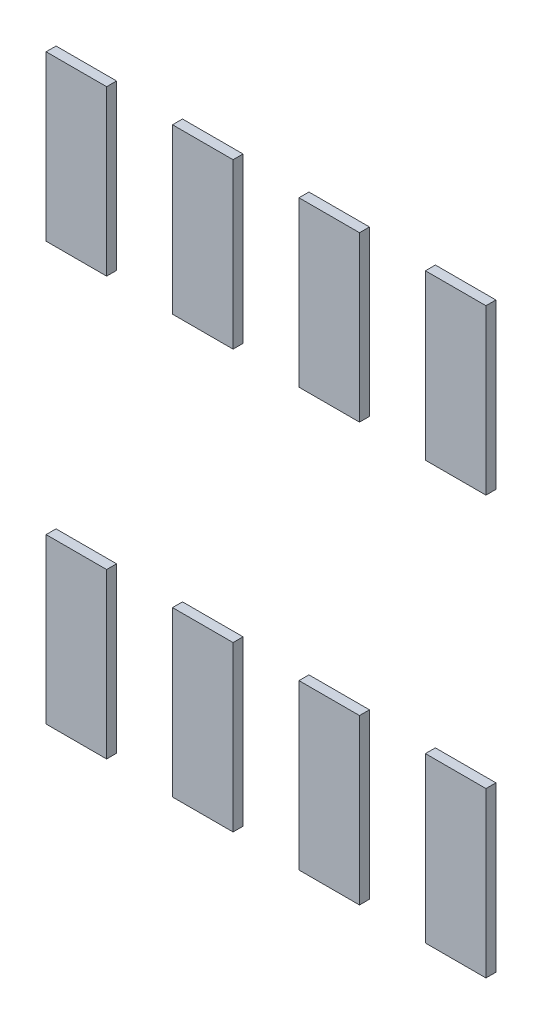
ISO-10303-21;
HEADER;
FILE_DESCRIPTION(('STEP AP214'),'2;1');
FILE_NAME('part.step','',(''),(''),'','','');
FILE_SCHEMA(('AUTOMOTIVE_DESIGN { 1 0 10303 214 1 1 1 1 }'));
ENDSEC;
DATA;
#1=APPLICATION_CONTEXT('core data for automotive mechanical design processes');
#2=APPLICATION_PROTOCOL_DEFINITION('international standard','automotive_design',2000,#1);
#3=PRODUCT_CONTEXT('',#1,'mechanical');
#4=PRODUCT('Part','Part','',(#3));
#5=PRODUCT_RELATED_PRODUCT_CATEGORY('part','',(#4));
#6=PRODUCT_DEFINITION_FORMATION('','',#4);
#7=PRODUCT_DEFINITION_CONTEXT('part definition',#1,'design');
#8=PRODUCT_DEFINITION('design','',#6,#7);
#9=PRODUCT_DEFINITION_SHAPE('','',#8);
#10=(LENGTH_UNIT() NAMED_UNIT(*) SI_UNIT(.MILLI.,.METRE.));
#11=(NAMED_UNIT(*) PLANE_ANGLE_UNIT() SI_UNIT($,.RADIAN.));
#12=(NAMED_UNIT(*) SI_UNIT($,.STERADIAN.) SOLID_ANGLE_UNIT());
#13=UNCERTAINTY_MEASURE_WITH_UNIT(LENGTH_MEASURE(1.E-05),#10,'distance_accuracy_value','');
#14=(GEOMETRIC_REPRESENTATION_CONTEXT(3) GLOBAL_UNCERTAINTY_ASSIGNED_CONTEXT((#13)) GLOBAL_UNIT_ASSIGNED_CONTEXT((#10,
#11,#12)) REPRESENTATION_CONTEXT('',''));
#15=CARTESIAN_POINT('',(0.,0.,0.));
#16=DIRECTION('',(0.,0.,1.));
#17=DIRECTION('',(1.,0.,0.));
#18=AXIS2_PLACEMENT_3D('',#15,#16,#17);
#19=CARTESIAN_POINT('',(-2.209,1.276,0.1));
#20=DIRECTION('',(0.,0.,1.));
#21=DIRECTION('',(1.,0.,0.));
#22=AXIS2_PLACEMENT_3D('',#19,#20,#21);
#23=PLANE('',#22);
#24=DIRECTION('',(0.,1.,0.));
#25=VECTOR('',#24,1.);
#26=CARTESIAN_POINT('',(-2.209,1.276,0.1));
#27=LINE('',#26,#25);
#28=CARTESIAN_POINT('',(-2.209,1.276,0.1));
#29=VERTEX_POINT('',#28);
#30=CARTESIAN_POINT('',(-2.209,2.924,0.1));
#31=VERTEX_POINT('',#30);
#32=EDGE_CURVE('P0_E65',#29,#31,#27,.T.);
#33=ORIENTED_EDGE('',*,*,#32,.F.);
#34=DIRECTION('',(1.,0.,0.));
#35=VECTOR('',#34,1.);
#36=CARTESIAN_POINT('',(-2.209,1.276,0.1));
#37=LINE('',#36,#35);
#38=CARTESIAN_POINT('',(-1.601,1.276,0.1));
#39=VERTEX_POINT('',#38);
#40=EDGE_CURVE('P0_E59',#29,#39,#37,.T.);
#41=ORIENTED_EDGE('',*,*,#40,.T.);
#42=DIRECTION('',(0.,1.,0.));
#43=VECTOR('',#42,1.);
#44=CARTESIAN_POINT('',(-1.601,1.276,0.1));
#45=LINE('',#44,#43);
#46=CARTESIAN_POINT('',(-1.601,2.924,0.1));
#47=VERTEX_POINT('',#46);
#48=EDGE_CURVE('P0_E61',#39,#47,#45,.T.);
#49=ORIENTED_EDGE('',*,*,#48,.T.);
#50=DIRECTION('',(1.,0.,0.));
#51=VECTOR('',#50,1.);
#52=CARTESIAN_POINT('',(-2.209,2.924,0.1));
#53=LINE('',#52,#51);
#54=EDGE_CURVE('P0_E11',#31,#47,#53,.T.);
#55=ORIENTED_EDGE('',*,*,#54,.F.);
#56=EDGE_LOOP('',(#33,#41,#49,#55));
#57=FACE_BOUND('',#56,.T.);
#58=ADVANCED_FACE('P0_F17',(#57),#23,.T.);
#59=CARTESIAN_POINT('',(-2.209,1.276,0.));
#60=DIRECTION('',(0.,0.,1.));
#61=DIRECTION('',(1.,0.,0.));
#62=AXIS2_PLACEMENT_3D('',#59,#60,#61);
#63=PLANE('',#62);
#64=DIRECTION('',(1.,0.,0.));
#65=VECTOR('',#64,1.);
#66=CARTESIAN_POINT('',(-2.209,2.924,0.));
#67=LINE('',#66,#65);
#68=CARTESIAN_POINT('',(-2.209,2.924,0.));
#69=VERTEX_POINT('',#68);
#70=CARTESIAN_POINT('',(-1.601,2.924,0.));
#71=VERTEX_POINT('',#70);
#72=EDGE_CURVE('P0_E21',#69,#71,#67,.T.);
#73=ORIENTED_EDGE('',*,*,#72,.T.);
#74=DIRECTION('',(0.,1.,0.));
#75=VECTOR('',#74,1.);
#76=CARTESIAN_POINT('',(-1.601,1.276,0.));
#77=LINE('',#76,#75);
#78=CARTESIAN_POINT('',(-1.601,1.276,0.));
#79=VERTEX_POINT('',#78);
#80=EDGE_CURVE('P0_E83',#79,#71,#77,.T.);
#81=ORIENTED_EDGE('',*,*,#80,.F.);
#82=DIRECTION('',(1.,0.,0.));
#83=VECTOR('',#82,1.);
#84=CARTESIAN_POINT('',(-2.209,1.276,0.));
#85=LINE('',#84,#83);
#86=CARTESIAN_POINT('',(-2.209,1.276,0.));
#87=VERTEX_POINT('',#86);
#88=EDGE_CURVE('P0_E71',#87,#79,#85,.T.);
#89=ORIENTED_EDGE('',*,*,#88,.F.);
#90=DIRECTION('',(0.,1.,0.));
#91=VECTOR('',#90,1.);
#92=CARTESIAN_POINT('',(-2.209,1.276,0.));
#93=LINE('',#92,#91);
#94=EDGE_CURVE('P0_E92',#87,#69,#93,.T.);
#95=ORIENTED_EDGE('',*,*,#94,.T.);
#96=EDGE_LOOP('',(#73,#81,#89,#95));
#97=FACE_BOUND('',#96,.T.);
#98=ADVANCED_FACE('P0_F19',(#97),#63,.F.);
#99=CARTESIAN_POINT('',(-2.209,2.924,0.));
#100=DIRECTION('',(0.,1.,0.));
#101=DIRECTION('',(1.,0.,0.));
#102=AXIS2_PLACEMENT_3D('',#99,#100,#101);
#103=PLANE('',#102);
#104=ORIENTED_EDGE('',*,*,#72,.F.);
#105=DIRECTION('',(0.,0.,1.));
#106=VECTOR('',#105,1.);
#107=CARTESIAN_POINT('',(-2.209,2.924,0.));
#108=LINE('',#107,#106);
#109=EDGE_CURVE('P0_E117',#69,#31,#108,.T.);
#110=ORIENTED_EDGE('',*,*,#109,.T.);
#111=ORIENTED_EDGE('',*,*,#54,.T.);
#112=DIRECTION('',(0.,0.,1.));
#113=VECTOR('',#112,1.);
#114=CARTESIAN_POINT('',(-1.601,2.924,0.));
#115=LINE('',#114,#113);
#116=EDGE_CURVE('P0_E77',#71,#47,#115,.T.);
#117=ORIENTED_EDGE('',*,*,#116,.F.);
#118=EDGE_LOOP('',(#104,#110,#111,#117));
#119=FACE_BOUND('',#118,.T.);
#120=ADVANCED_FACE('P0_F154',(#119),#103,.T.);
#121=CARTESIAN_POINT('',(-2.209,1.276,0.));
#122=DIRECTION('',(0.,1.,0.));
#123=DIRECTION('',(1.,0.,0.));
#124=AXIS2_PLACEMENT_3D('',#121,#122,#123);
#125=PLANE('',#124);
#126=DIRECTION('',(0.,0.,1.));
#127=VECTOR('',#126,1.);
#128=CARTESIAN_POINT('',(-1.601,1.276,0.));
#129=LINE('',#128,#127);
#130=EDGE_CURVE('P0_E76',#79,#39,#129,.T.);
#131=ORIENTED_EDGE('',*,*,#130,.T.);
#132=ORIENTED_EDGE('',*,*,#40,.F.);
#133=DIRECTION('',(0.,0.,1.));
#134=VECTOR('',#133,1.);
#135=CARTESIAN_POINT('',(-2.209,1.276,0.));
#136=LINE('',#135,#134);
#137=EDGE_CURVE('P0_E84',#87,#29,#136,.T.);
#138=ORIENTED_EDGE('',*,*,#137,.F.);
#139=ORIENTED_EDGE('',*,*,#88,.T.);
#140=EDGE_LOOP('',(#131,#132,#138,#139));
#141=FACE_BOUND('',#140,.T.);
#142=ADVANCED_FACE('P0_F80',(#141),#125,.F.);
#143=CARTESIAN_POINT('',(-1.601,1.276,0.));
#144=DIRECTION('',(1.,0.,0.));
#145=DIRECTION('',(0.,1.,0.));
#146=AXIS2_PLACEMENT_3D('',#143,#144,#145);
#147=PLANE('',#146);
#148=ORIENTED_EDGE('',*,*,#130,.F.);
#149=ORIENTED_EDGE('',*,*,#80,.T.);
#150=ORIENTED_EDGE('',*,*,#116,.T.);
#151=ORIENTED_EDGE('',*,*,#48,.F.);
#152=EDGE_LOOP('',(#148,#149,#150,#151));
#153=FACE_BOUND('',#152,.T.);
#154=ADVANCED_FACE('P0_F74',(#153),#147,.T.);
#155=CARTESIAN_POINT('',(-2.209,1.276,0.));
#156=DIRECTION('',(1.,0.,0.));
#157=DIRECTION('',(0.,1.,0.));
#158=AXIS2_PLACEMENT_3D('',#155,#156,#157);
#159=PLANE('',#158);
#160=ORIENTED_EDGE('',*,*,#32,.T.);
#161=ORIENTED_EDGE('',*,*,#109,.F.);
#162=ORIENTED_EDGE('',*,*,#94,.F.);
#163=ORIENTED_EDGE('',*,*,#137,.T.);
#164=EDGE_LOOP('',(#160,#161,#162,#163));
#165=FACE_BOUND('',#164,.T.);
#166=ADVANCED_FACE('P0_F141',(#165),#159,.F.);
#167=CLOSED_SHELL('',(#58,#98,#120,#142,#154,#166));
#168=MANIFOLD_SOLID_BREP('P0_B1',#167);
#169=CARTESIAN_POINT('',(-2.209,-2.924,0.1));
#170=DIRECTION('',(0.,0.,1.));
#171=DIRECTION('',(1.,0.,0.));
#172=AXIS2_PLACEMENT_3D('',#169,#170,#171);
#173=PLANE('',#172);
#174=DIRECTION('',(0.,1.,0.));
#175=VECTOR('',#174,1.);
#176=CARTESIAN_POINT('',(-2.209,-2.924,0.1));
#177=LINE('',#176,#175);
#178=CARTESIAN_POINT('',(-2.209,-2.924,0.1));
#179=VERTEX_POINT('',#178);
#180=CARTESIAN_POINT('',(-2.209,-1.276,0.1));
#181=VERTEX_POINT('',#180);
#182=EDGE_CURVE('P1_E108',#179,#181,#177,.T.);
#183=ORIENTED_EDGE('',*,*,#182,.F.);
#184=DIRECTION('',(1.,0.,0.));
#185=VECTOR('',#184,1.);
#186=CARTESIAN_POINT('',(-2.209,-2.924,0.1));
#187=LINE('',#186,#185);
#188=CARTESIAN_POINT('',(-1.601,-2.924,0.1));
#189=VERTEX_POINT('',#188);
#190=EDGE_CURVE('P1_E78',#179,#189,#187,.T.);
#191=ORIENTED_EDGE('',*,*,#190,.T.);
#192=DIRECTION('',(0.,1.,0.));
#193=VECTOR('',#192,1.);
#194=CARTESIAN_POINT('',(-1.601,-2.924,0.1));
#195=LINE('',#194,#193);
#196=CARTESIAN_POINT('',(-1.601,-1.276,0.1));
#197=VERTEX_POINT('',#196);
#198=EDGE_CURVE('P1_E89',#189,#197,#195,.T.);
#199=ORIENTED_EDGE('',*,*,#198,.T.);
#200=DIRECTION('',(1.,0.,0.));
#201=VECTOR('',#200,1.);
#202=CARTESIAN_POINT('',(-2.209,-1.276,0.1));
#203=LINE('',#202,#201);
#204=EDGE_CURVE('P1_E11',#181,#197,#203,.T.);
#205=ORIENTED_EDGE('',*,*,#204,.F.);
#206=EDGE_LOOP('',(#183,#191,#199,#205));
#207=FACE_BOUND('',#206,.T.);
#208=ADVANCED_FACE('P1_F17',(#207),#173,.T.);
#209=CARTESIAN_POINT('',(-2.209,-2.924,0.));
#210=DIRECTION('',(0.,0.,1.));
#211=DIRECTION('',(1.,0.,0.));
#212=AXIS2_PLACEMENT_3D('',#209,#210,#211);
#213=PLANE('',#212);
#214=DIRECTION('',(1.,0.,0.));
#215=VECTOR('',#214,1.);
#216=CARTESIAN_POINT('',(-2.209,-1.276,0.));
#217=LINE('',#216,#215);
#218=CARTESIAN_POINT('',(-2.209,-1.276,0.));
#219=VERTEX_POINT('',#218);
#220=CARTESIAN_POINT('',(-1.601,-1.276,0.));
#221=VERTEX_POINT('',#220);
#222=EDGE_CURVE('P1_E26',#219,#221,#217,.T.);
#223=ORIENTED_EDGE('',*,*,#222,.T.);
#224=DIRECTION('',(0.,1.,0.));
#225=VECTOR('',#224,1.);
#226=CARTESIAN_POINT('',(-1.601,-2.924,0.));
#227=LINE('',#226,#225);
#228=CARTESIAN_POINT('',(-1.601,-2.924,0.));
#229=VERTEX_POINT('',#228);
#230=EDGE_CURVE('P1_E80',#229,#221,#227,.T.);
#231=ORIENTED_EDGE('',*,*,#230,.F.);
#232=DIRECTION('',(1.,0.,0.));
#233=VECTOR('',#232,1.);
#234=CARTESIAN_POINT('',(-2.209,-2.924,0.));
#235=LINE('',#234,#233);
#236=CARTESIAN_POINT('',(-2.209,-2.924,0.));
#237=VERTEX_POINT('',#236);
#238=EDGE_CURVE('P1_E20',#237,#229,#235,.T.);
#239=ORIENTED_EDGE('',*,*,#238,.F.);
#240=DIRECTION('',(0.,1.,0.));
#241=VECTOR('',#240,1.);
#242=CARTESIAN_POINT('',(-2.209,-2.924,0.));
#243=LINE('',#242,#241);
#244=EDGE_CURVE('P1_E96',#237,#219,#243,.T.);
#245=ORIENTED_EDGE('',*,*,#244,.T.);
#246=EDGE_LOOP('',(#223,#231,#239,#245));
#247=FACE_BOUND('',#246,.T.);
#248=ADVANCED_FACE('P1_F81',(#247),#213,.F.);
#249=CARTESIAN_POINT('',(-2.209,-1.276,0.));
#250=DIRECTION('',(0.,1.,0.));
#251=DIRECTION('',(1.,0.,0.));
#252=AXIS2_PLACEMENT_3D('',#249,#250,#251);
#253=PLANE('',#252);
#254=ORIENTED_EDGE('',*,*,#222,.F.);
#255=DIRECTION('',(0.,0.,1.));
#256=VECTOR('',#255,1.);
#257=CARTESIAN_POINT('',(-2.209,-1.276,0.));
#258=LINE('',#257,#256);
#259=EDGE_CURVE('P1_E112',#219,#181,#258,.T.);
#260=ORIENTED_EDGE('',*,*,#259,.T.);
#261=ORIENTED_EDGE('',*,*,#204,.T.);
#262=DIRECTION('',(0.,0.,1.));
#263=VECTOR('',#262,1.);
#264=CARTESIAN_POINT('',(-1.601,-1.276,0.));
#265=LINE('',#264,#263);
#266=EDGE_CURVE('P1_E85',#221,#197,#265,.T.);
#267=ORIENTED_EDGE('',*,*,#266,.F.);
#268=EDGE_LOOP('',(#254,#260,#261,#267));
#269=FACE_BOUND('',#268,.T.);
#270=ADVANCED_FACE('P1_F156',(#269),#253,.T.);
#271=CARTESIAN_POINT('',(-2.209,-2.924,0.));
#272=DIRECTION('',(0.,1.,0.));
#273=DIRECTION('',(1.,0.,0.));
#274=AXIS2_PLACEMENT_3D('',#271,#272,#273);
#275=PLANE('',#274);
#276=DIRECTION('',(0.,0.,1.));
#277=VECTOR('',#276,1.);
#278=CARTESIAN_POINT('',(-1.601,-2.924,0.));
#279=LINE('',#278,#277);
#280=EDGE_CURVE('P1_E73',#229,#189,#279,.T.);
#281=ORIENTED_EDGE('',*,*,#280,.T.);
#282=ORIENTED_EDGE('',*,*,#190,.F.);
#283=DIRECTION('',(0.,0.,1.));
#284=VECTOR('',#283,1.);
#285=CARTESIAN_POINT('',(-2.209,-2.924,0.));
#286=LINE('',#285,#284);
#287=EDGE_CURVE('P1_E75',#237,#179,#286,.T.);
#288=ORIENTED_EDGE('',*,*,#287,.F.);
#289=ORIENTED_EDGE('',*,*,#238,.T.);
#290=EDGE_LOOP('',(#281,#282,#288,#289));
#291=FACE_BOUND('',#290,.T.);
#292=ADVANCED_FACE('P1_F70',(#291),#275,.F.);
#293=CARTESIAN_POINT('',(-1.601,-2.924,0.));
#294=DIRECTION('',(1.,0.,0.));
#295=DIRECTION('',(0.,1.,0.));
#296=AXIS2_PLACEMENT_3D('',#293,#294,#295);
#297=PLANE('',#296);
#298=ORIENTED_EDGE('',*,*,#280,.F.);
#299=ORIENTED_EDGE('',*,*,#230,.T.);
#300=ORIENTED_EDGE('',*,*,#266,.T.);
#301=ORIENTED_EDGE('',*,*,#198,.F.);
#302=EDGE_LOOP('',(#298,#299,#300,#301));
#303=FACE_BOUND('',#302,.T.);
#304=ADVANCED_FACE('P1_F88',(#303),#297,.T.);
#305=CARTESIAN_POINT('',(-2.209,-2.924,0.));
#306=DIRECTION('',(1.,0.,0.));
#307=DIRECTION('',(0.,1.,0.));
#308=AXIS2_PLACEMENT_3D('',#305,#306,#307);
#309=PLANE('',#308);
#310=ORIENTED_EDGE('',*,*,#182,.T.);
#311=ORIENTED_EDGE('',*,*,#259,.F.);
#312=ORIENTED_EDGE('',*,*,#244,.F.);
#313=ORIENTED_EDGE('',*,*,#287,.T.);
#314=EDGE_LOOP('',(#310,#311,#312,#313));
#315=FACE_BOUND('',#314,.T.);
#316=ADVANCED_FACE('P1_F110',(#315),#309,.F.);
#317=CLOSED_SHELL('',(#208,#248,#270,#292,#304,#316));
#318=MANIFOLD_SOLID_BREP('P1_B1',#317);
#319=CARTESIAN_POINT('',(-0.939,1.276,0.1));
#320=DIRECTION('',(0.,0.,1.));
#321=DIRECTION('',(1.,0.,0.));
#322=AXIS2_PLACEMENT_3D('',#319,#320,#321);
#323=PLANE('',#322);
#324=DIRECTION('',(0.,1.,0.));
#325=VECTOR('',#324,1.);
#326=CARTESIAN_POINT('',(-0.939,1.276,0.1));
#327=LINE('',#326,#325);
#328=CARTESIAN_POINT('',(-0.939,1.276,0.1));
#329=VERTEX_POINT('',#328);
#330=CARTESIAN_POINT('',(-0.939,2.924,0.1));
#331=VERTEX_POINT('',#330);
#332=EDGE_CURVE('P2_E91',#329,#331,#327,.T.);
#333=ORIENTED_EDGE('',*,*,#332,.F.);
#334=DIRECTION('',(1.,0.,0.));
#335=VECTOR('',#334,1.);
#336=CARTESIAN_POINT('',(-0.939,1.276,0.1));
#337=LINE('',#336,#335);
#338=CARTESIAN_POINT('',(-0.331,1.276,0.1));
#339=VERTEX_POINT('',#338);
#340=EDGE_CURVE('P2_E74',#329,#339,#337,.T.);
#341=ORIENTED_EDGE('',*,*,#340,.T.);
#342=DIRECTION('',(0.,1.,0.));
#343=VECTOR('',#342,1.);
#344=CARTESIAN_POINT('',(-0.331,1.276,0.1));
#345=LINE('',#344,#343);
#346=CARTESIAN_POINT('',(-0.331,2.924,0.1));
#347=VERTEX_POINT('',#346);
#348=EDGE_CURVE('P2_E85',#339,#347,#345,.T.);
#349=ORIENTED_EDGE('',*,*,#348,.T.);
#350=DIRECTION('',(1.,0.,0.));
#351=VECTOR('',#350,1.);
#352=CARTESIAN_POINT('',(-0.939,2.924,0.1));
#353=LINE('',#352,#351);
#354=EDGE_CURVE('P2_E11',#331,#347,#353,.T.);
#355=ORIENTED_EDGE('',*,*,#354,.F.);
#356=EDGE_LOOP('',(#333,#341,#349,#355));
#357=FACE_BOUND('',#356,.T.);
#358=ADVANCED_FACE('P2_F17',(#357),#323,.T.);
#359=CARTESIAN_POINT('',(-0.939,1.276,0.));
#360=DIRECTION('',(0.,0.,1.));
#361=DIRECTION('',(1.,0.,0.));
#362=AXIS2_PLACEMENT_3D('',#359,#360,#361);
#363=PLANE('',#362);
#364=DIRECTION('',(1.,0.,0.));
#365=VECTOR('',#364,1.);
#366=CARTESIAN_POINT('',(-0.939,2.924,0.));
#367=LINE('',#366,#365);
#368=CARTESIAN_POINT('',(-0.939,2.924,0.));
#369=VERTEX_POINT('',#368);
#370=CARTESIAN_POINT('',(-0.331,2.924,0.));
#371=VERTEX_POINT('',#370);
#372=EDGE_CURVE('P2_E20',#369,#371,#367,.T.);
#373=ORIENTED_EDGE('',*,*,#372,.T.);
#374=DIRECTION('',(0.,1.,0.));
#375=VECTOR('',#374,1.);
#376=CARTESIAN_POINT('',(-0.331,1.276,0.));
#377=LINE('',#376,#375);
#378=CARTESIAN_POINT('',(-0.331,1.276,0.));
#379=VERTEX_POINT('',#378);
#380=EDGE_CURVE('P2_E110',#379,#371,#377,.T.);
#381=ORIENTED_EDGE('',*,*,#380,.F.);
#382=DIRECTION('',(1.,0.,0.));
#383=VECTOR('',#382,1.);
#384=CARTESIAN_POINT('',(-0.939,1.276,0.));
#385=LINE('',#384,#383);
#386=CARTESIAN_POINT('',(-0.939,1.276,0.));
#387=VERTEX_POINT('',#386);
#388=EDGE_CURVE('P2_E60',#387,#379,#385,.T.);
#389=ORIENTED_EDGE('',*,*,#388,.F.);
#390=DIRECTION('',(0.,1.,0.));
#391=VECTOR('',#390,1.);
#392=CARTESIAN_POINT('',(-0.939,1.276,0.));
#393=LINE('',#392,#391);
#394=EDGE_CURVE('P2_E92',#387,#369,#393,.T.);
#395=ORIENTED_EDGE('',*,*,#394,.T.);
#396=EDGE_LOOP('',(#373,#381,#389,#395));
#397=FACE_BOUND('',#396,.T.);
#398=ADVANCED_FACE('P2_F125',(#397),#363,.F.);
#399=CARTESIAN_POINT('',(-0.939,2.924,0.));
#400=DIRECTION('',(0.,1.,0.));
#401=DIRECTION('',(1.,0.,0.));
#402=AXIS2_PLACEMENT_3D('',#399,#400,#401);
#403=PLANE('',#402);
#404=ORIENTED_EDGE('',*,*,#372,.F.);
#405=DIRECTION('',(0.,0.,1.));
#406=VECTOR('',#405,1.);
#407=CARTESIAN_POINT('',(-0.939,2.924,0.));
#408=LINE('',#407,#406);
#409=EDGE_CURVE('P2_E96',#369,#331,#408,.T.);
#410=ORIENTED_EDGE('',*,*,#409,.T.);
#411=ORIENTED_EDGE('',*,*,#354,.T.);
#412=DIRECTION('',(0.,0.,1.));
#413=VECTOR('',#412,1.);
#414=CARTESIAN_POINT('',(-0.331,2.924,0.));
#415=LINE('',#414,#413);
#416=EDGE_CURVE('P2_E113',#371,#347,#415,.T.);
#417=ORIENTED_EDGE('',*,*,#416,.F.);
#418=EDGE_LOOP('',(#404,#410,#411,#417));
#419=FACE_BOUND('',#418,.T.);
#420=ADVANCED_FACE('P2_F123',(#419),#403,.T.);
#421=CARTESIAN_POINT('',(-0.939,1.276,0.));
#422=DIRECTION('',(0.,1.,0.));
#423=DIRECTION('',(1.,0.,0.));
#424=AXIS2_PLACEMENT_3D('',#421,#422,#423);
#425=PLANE('',#424);
#426=DIRECTION('',(0.,0.,1.));
#427=VECTOR('',#426,1.);
#428=CARTESIAN_POINT('',(-0.331,1.276,0.));
#429=LINE('',#428,#427);
#430=EDGE_CURVE('P2_E80',#379,#339,#429,.T.);
#431=ORIENTED_EDGE('',*,*,#430,.T.);
#432=ORIENTED_EDGE('',*,*,#340,.F.);
#433=DIRECTION('',(0.,0.,1.));
#434=VECTOR('',#433,1.);
#435=CARTESIAN_POINT('',(-0.939,1.276,0.));
#436=LINE('',#435,#434);
#437=EDGE_CURVE('P2_E77',#387,#329,#436,.T.);
#438=ORIENTED_EDGE('',*,*,#437,.F.);
#439=ORIENTED_EDGE('',*,*,#388,.T.);
#440=EDGE_LOOP('',(#431,#432,#438,#439));
#441=FACE_BOUND('',#440,.T.);
#442=ADVANCED_FACE('P2_F76',(#441),#425,.F.);
#443=CARTESIAN_POINT('',(-0.331,1.276,0.));
#444=DIRECTION('',(1.,0.,0.));
#445=DIRECTION('',(0.,1.,0.));
#446=AXIS2_PLACEMENT_3D('',#443,#444,#445);
#447=PLANE('',#446);
#448=ORIENTED_EDGE('',*,*,#430,.F.);
#449=ORIENTED_EDGE('',*,*,#380,.T.);
#450=ORIENTED_EDGE('',*,*,#416,.T.);
#451=ORIENTED_EDGE('',*,*,#348,.F.);
#452=EDGE_LOOP('',(#448,#449,#450,#451));
#453=FACE_BOUND('',#452,.T.);
#454=ADVANCED_FACE('P2_F122',(#453),#447,.T.);
#455=CARTESIAN_POINT('',(-0.939,1.276,0.));
#456=DIRECTION('',(1.,0.,0.));
#457=DIRECTION('',(0.,1.,0.));
#458=AXIS2_PLACEMENT_3D('',#455,#456,#457);
#459=PLANE('',#458);
#460=ORIENTED_EDGE('',*,*,#332,.T.);
#461=ORIENTED_EDGE('',*,*,#409,.F.);
#462=ORIENTED_EDGE('',*,*,#394,.F.);
#463=ORIENTED_EDGE('',*,*,#437,.T.);
#464=EDGE_LOOP('',(#460,#461,#462,#463));
#465=FACE_BOUND('',#464,.T.);
#466=ADVANCED_FACE('P2_F89',(#465),#459,.F.);
#467=CLOSED_SHELL('',(#358,#398,#420,#442,#454,#466));
#468=MANIFOLD_SOLID_BREP('P2_B1',#467);
#469=CARTESIAN_POINT('',(-0.939,-2.924,0.1));
#470=DIRECTION('',(0.,0.,1.));
#471=DIRECTION('',(1.,0.,0.));
#472=AXIS2_PLACEMENT_3D('',#469,#470,#471);
#473=PLANE('',#472);
#474=DIRECTION('',(0.,1.,0.));
#475=VECTOR('',#474,1.);
#476=CARTESIAN_POINT('',(-0.939,-2.924,0.1));
#477=LINE('',#476,#475);
#478=CARTESIAN_POINT('',(-0.939,-2.924,0.1));
#479=VERTEX_POINT('',#478);
#480=CARTESIAN_POINT('',(-0.939,-1.276,0.1));
#481=VERTEX_POINT('',#480);
#482=EDGE_CURVE('P3_E88',#479,#481,#477,.T.);
#483=ORIENTED_EDGE('',*,*,#482,.F.);
#484=DIRECTION('',(1.,0.,0.));
#485=VECTOR('',#484,1.);
#486=CARTESIAN_POINT('',(-0.939,-2.924,0.1));
#487=LINE('',#486,#485);
#488=CARTESIAN_POINT('',(-0.331,-2.924,0.1));
#489=VERTEX_POINT('',#488);
#490=EDGE_CURVE('P3_E72',#479,#489,#487,.T.);
#491=ORIENTED_EDGE('',*,*,#490,.T.);
#492=DIRECTION('',(0.,1.,0.));
#493=VECTOR('',#492,1.);
#494=CARTESIAN_POINT('',(-0.331,-2.924,0.1));
#495=LINE('',#494,#493);
#496=CARTESIAN_POINT('',(-0.331,-1.276,0.1));
#497=VERTEX_POINT('',#496);
#498=EDGE_CURVE('P3_E83',#489,#497,#495,.T.);
#499=ORIENTED_EDGE('',*,*,#498,.T.);
#500=DIRECTION('',(1.,0.,0.));
#501=VECTOR('',#500,1.);
#502=CARTESIAN_POINT('',(-0.939,-1.276,0.1));
#503=LINE('',#502,#501);
#504=EDGE_CURVE('P3_E11',#481,#497,#503,.T.);
#505=ORIENTED_EDGE('',*,*,#504,.F.);
#506=EDGE_LOOP('',(#483,#491,#499,#505));
#507=FACE_BOUND('',#506,.T.);
#508=ADVANCED_FACE('P3_F17',(#507),#473,.T.);
#509=CARTESIAN_POINT('',(-0.939,-2.924,0.));
#510=DIRECTION('',(0.,0.,1.));
#511=DIRECTION('',(1.,0.,0.));
#512=AXIS2_PLACEMENT_3D('',#509,#510,#511);
#513=PLANE('',#512);
#514=DIRECTION('',(1.,0.,0.));
#515=VECTOR('',#514,1.);
#516=CARTESIAN_POINT('',(-0.939,-1.276,0.));
#517=LINE('',#516,#515);
#518=CARTESIAN_POINT('',(-0.939,-1.276,0.));
#519=VERTEX_POINT('',#518);
#520=CARTESIAN_POINT('',(-0.331,-1.276,0.));
#521=VERTEX_POINT('',#520);
#522=EDGE_CURVE('P3_E26',#519,#521,#517,.T.);
#523=ORIENTED_EDGE('',*,*,#522,.T.);
#524=DIRECTION('',(0.,1.,0.));
#525=VECTOR('',#524,1.);
#526=CARTESIAN_POINT('',(-0.331,-2.924,0.));
#527=LINE('',#526,#525);
#528=CARTESIAN_POINT('',(-0.331,-2.924,0.));
#529=VERTEX_POINT('',#528);
#530=EDGE_CURVE('P3_E107',#529,#521,#527,.T.);
#531=ORIENTED_EDGE('',*,*,#530,.F.);
#532=DIRECTION('',(1.,0.,0.));
#533=VECTOR('',#532,1.);
#534=CARTESIAN_POINT('',(-0.939,-2.924,0.));
#535=LINE('',#534,#533);
#536=CARTESIAN_POINT('',(-0.939,-2.924,0.));
#537=VERTEX_POINT('',#536);
#538=EDGE_CURVE('P3_E20',#537,#529,#535,.T.);
#539=ORIENTED_EDGE('',*,*,#538,.F.);
#540=DIRECTION('',(0.,1.,0.));
#541=VECTOR('',#540,1.);
#542=CARTESIAN_POINT('',(-0.939,-2.924,0.));
#543=LINE('',#542,#541);
#544=EDGE_CURVE('P3_E89',#537,#519,#543,.T.);
#545=ORIENTED_EDGE('',*,*,#544,.T.);
#546=EDGE_LOOP('',(#523,#531,#539,#545));
#547=FACE_BOUND('',#546,.T.);
#548=ADVANCED_FACE('P3_F123',(#547),#513,.F.);
#549=CARTESIAN_POINT('',(-0.939,-1.276,0.));
#550=DIRECTION('',(0.,1.,0.));
#551=DIRECTION('',(1.,0.,0.));
#552=AXIS2_PLACEMENT_3D('',#549,#550,#551);
#553=PLANE('',#552);
#554=ORIENTED_EDGE('',*,*,#522,.F.);
#555=DIRECTION('',(0.,0.,1.));
#556=VECTOR('',#555,1.);
#557=CARTESIAN_POINT('',(-0.939,-1.276,0.));
#558=LINE('',#557,#556);
#559=EDGE_CURVE('P3_E93',#519,#481,#558,.T.);
#560=ORIENTED_EDGE('',*,*,#559,.T.);
#561=ORIENTED_EDGE('',*,*,#504,.T.);
#562=DIRECTION('',(0.,0.,1.));
#563=VECTOR('',#562,1.);
#564=CARTESIAN_POINT('',(-0.331,-1.276,0.));
#565=LINE('',#564,#563);
#566=EDGE_CURVE('P3_E101',#521,#497,#565,.T.);
#567=ORIENTED_EDGE('',*,*,#566,.F.);
#568=EDGE_LOOP('',(#554,#560,#561,#567));
#569=FACE_BOUND('',#568,.T.);
#570=ADVANCED_FACE('P3_F122',(#569),#553,.T.);
#571=CARTESIAN_POINT('',(-0.939,-2.924,0.));
#572=DIRECTION('',(0.,1.,0.));
#573=DIRECTION('',(1.,0.,0.));
#574=AXIS2_PLACEMENT_3D('',#571,#572,#573);
#575=PLANE('',#574);
#576=DIRECTION('',(0.,0.,1.));
#577=VECTOR('',#576,1.);
#578=CARTESIAN_POINT('',(-0.331,-2.924,0.));
#579=LINE('',#578,#577);
#580=EDGE_CURVE('P3_E78',#529,#489,#579,.T.);
#581=ORIENTED_EDGE('',*,*,#580,.T.);
#582=ORIENTED_EDGE('',*,*,#490,.F.);
#583=DIRECTION('',(0.,0.,1.));
#584=VECTOR('',#583,1.);
#585=CARTESIAN_POINT('',(-0.939,-2.924,0.));
#586=LINE('',#585,#584);
#587=EDGE_CURVE('P3_E75',#537,#479,#586,.T.);
#588=ORIENTED_EDGE('',*,*,#587,.F.);
#589=ORIENTED_EDGE('',*,*,#538,.T.);
#590=EDGE_LOOP('',(#581,#582,#588,#589));
#591=FACE_BOUND('',#590,.T.);
#592=ADVANCED_FACE('P3_F74',(#591),#575,.F.);
#593=CARTESIAN_POINT('',(-0.331,-2.924,0.));
#594=DIRECTION('',(1.,0.,0.));
#595=DIRECTION('',(0.,1.,0.));
#596=AXIS2_PLACEMENT_3D('',#593,#594,#595);
#597=PLANE('',#596);
#598=ORIENTED_EDGE('',*,*,#580,.F.);
#599=ORIENTED_EDGE('',*,*,#530,.T.);
#600=ORIENTED_EDGE('',*,*,#566,.T.);
#601=ORIENTED_EDGE('',*,*,#498,.F.);
#602=EDGE_LOOP('',(#598,#599,#600,#601));
#603=FACE_BOUND('',#602,.T.);
#604=ADVANCED_FACE('P3_F121',(#603),#597,.T.);
#605=CARTESIAN_POINT('',(-0.939,-2.924,0.));
#606=DIRECTION('',(1.,0.,0.));
#607=DIRECTION('',(0.,1.,0.));
#608=AXIS2_PLACEMENT_3D('',#605,#606,#607);
#609=PLANE('',#608);
#610=ORIENTED_EDGE('',*,*,#482,.T.);
#611=ORIENTED_EDGE('',*,*,#559,.F.);
#612=ORIENTED_EDGE('',*,*,#544,.F.);
#613=ORIENTED_EDGE('',*,*,#587,.T.);
#614=EDGE_LOOP('',(#610,#611,#612,#613));
#615=FACE_BOUND('',#614,.T.);
#616=ADVANCED_FACE('P3_F86',(#615),#609,.F.);
#617=CLOSED_SHELL('',(#508,#548,#570,#592,#604,#616));
#618=MANIFOLD_SOLID_BREP('P3_B1',#617);
#619=CARTESIAN_POINT('',(0.331,1.276,0.1));
#620=DIRECTION('',(0.,0.,1.));
#621=DIRECTION('',(1.,0.,0.));
#622=AXIS2_PLACEMENT_3D('',#619,#620,#621);
#623=PLANE('',#622);
#624=DIRECTION('',(0.,1.,0.));
#625=VECTOR('',#624,1.);
#626=CARTESIAN_POINT('',(0.331,1.276,0.1));
#627=LINE('',#626,#625);
#628=CARTESIAN_POINT('',(0.331,1.276,0.1));
#629=VERTEX_POINT('',#628);
#630=CARTESIAN_POINT('',(0.331,2.924,0.1));
#631=VERTEX_POINT('',#630);
#632=EDGE_CURVE('P4_E75',#629,#631,#627,.T.);
#633=ORIENTED_EDGE('',*,*,#632,.F.);
#634=DIRECTION('',(1.,0.,0.));
#635=VECTOR('',#634,1.);
#636=CARTESIAN_POINT('',(0.331,1.276,0.1));
#637=LINE('',#636,#635);
#638=CARTESIAN_POINT('',(0.939,1.276,0.1));
#639=VERTEX_POINT('',#638);
#640=EDGE_CURVE('P4_E69',#629,#639,#637,.T.);
#641=ORIENTED_EDGE('',*,*,#640,.T.);
#642=DIRECTION('',(0.,1.,0.));
#643=VECTOR('',#642,1.);
#644=CARTESIAN_POINT('',(0.939,1.276,0.1));
#645=LINE('',#644,#643);
#646=CARTESIAN_POINT('',(0.939,2.924,0.1));
#647=VERTEX_POINT('',#646);
#648=EDGE_CURVE('P4_E71',#639,#647,#645,.T.);
#649=ORIENTED_EDGE('',*,*,#648,.T.);
#650=DIRECTION('',(1.,0.,0.));
#651=VECTOR('',#650,1.);
#652=CARTESIAN_POINT('',(0.331,2.924,0.1));
#653=LINE('',#652,#651);
#654=EDGE_CURVE('P4_E11',#631,#647,#653,.T.);
#655=ORIENTED_EDGE('',*,*,#654,.F.);
#656=EDGE_LOOP('',(#633,#641,#649,#655));
#657=FACE_BOUND('',#656,.T.);
#658=ADVANCED_FACE('P4_F17',(#657),#623,.T.);
#659=CARTESIAN_POINT('',(0.331,1.276,0.));
#660=DIRECTION('',(0.,0.,1.));
#661=DIRECTION('',(1.,0.,0.));
#662=AXIS2_PLACEMENT_3D('',#659,#660,#661);
#663=PLANE('',#662);
#664=DIRECTION('',(1.,0.,0.));
#665=VECTOR('',#664,1.);
#666=CARTESIAN_POINT('',(0.331,2.924,0.));
#667=LINE('',#666,#665);
#668=CARTESIAN_POINT('',(0.331,2.924,0.));
#669=VERTEX_POINT('',#668);
#670=CARTESIAN_POINT('',(0.939,2.924,0.));
#671=VERTEX_POINT('',#670);
#672=EDGE_CURVE('P4_E27',#669,#671,#667,.T.);
#673=ORIENTED_EDGE('',*,*,#672,.T.);
#674=DIRECTION('',(0.,1.,0.));
#675=VECTOR('',#674,1.);
#676=CARTESIAN_POINT('',(0.939,1.276,0.));
#677=LINE('',#676,#675);
#678=CARTESIAN_POINT('',(0.939,1.276,0.));
#679=VERTEX_POINT('',#678);
#680=EDGE_CURVE('P4_E88',#679,#671,#677,.T.);
#681=ORIENTED_EDGE('',*,*,#680,.F.);
#682=DIRECTION('',(1.,0.,0.));
#683=VECTOR('',#682,1.);
#684=CARTESIAN_POINT('',(0.331,1.276,0.));
#685=LINE('',#684,#683);
#686=CARTESIAN_POINT('',(0.331,1.276,0.));
#687=VERTEX_POINT('',#686);
#688=EDGE_CURVE('P4_E61',#687,#679,#685,.T.);
#689=ORIENTED_EDGE('',*,*,#688,.F.);
#690=DIRECTION('',(0.,1.,0.));
#691=VECTOR('',#690,1.);
#692=CARTESIAN_POINT('',(0.331,1.276,0.));
#693=LINE('',#692,#691);
#694=EDGE_CURVE('P4_E97',#687,#669,#693,.T.);
#695=ORIENTED_EDGE('',*,*,#694,.T.);
#696=EDGE_LOOP('',(#673,#681,#689,#695));
#697=FACE_BOUND('',#696,.T.);
#698=ADVANCED_FACE('P4_F19',(#697),#663,.F.);
#699=CARTESIAN_POINT('',(0.331,2.924,0.));
#700=DIRECTION('',(0.,1.,0.));
#701=DIRECTION('',(1.,0.,0.));
#702=AXIS2_PLACEMENT_3D('',#699,#700,#701);
#703=PLANE('',#702);
#704=ORIENTED_EDGE('',*,*,#672,.F.);
#705=DIRECTION('',(0.,0.,1.));
#706=VECTOR('',#705,1.);
#707=CARTESIAN_POINT('',(0.331,2.924,0.));
#708=LINE('',#707,#706);
#709=EDGE_CURVE('P4_E119',#669,#631,#708,.T.);
#710=ORIENTED_EDGE('',*,*,#709,.T.);
#711=ORIENTED_EDGE('',*,*,#654,.T.);
#712=DIRECTION('',(0.,0.,1.));
#713=VECTOR('',#712,1.);
#714=CARTESIAN_POINT('',(0.939,2.924,0.));
#715=LINE('',#714,#713);
#716=EDGE_CURVE('P4_E83',#671,#647,#715,.T.);
#717=ORIENTED_EDGE('',*,*,#716,.F.);
#718=EDGE_LOOP('',(#704,#710,#711,#717));
#719=FACE_BOUND('',#718,.T.);
#720=ADVANCED_FACE('P4_F112',(#719),#703,.T.);
#721=CARTESIAN_POINT('',(0.331,1.276,0.));
#722=DIRECTION('',(0.,1.,0.));
#723=DIRECTION('',(1.,0.,0.));
#724=AXIS2_PLACEMENT_3D('',#721,#722,#723);
#725=PLANE('',#724);
#726=DIRECTION('',(0.,0.,1.));
#727=VECTOR('',#726,1.);
#728=CARTESIAN_POINT('',(0.939,1.276,0.));
#729=LINE('',#728,#727);
#730=EDGE_CURVE('P4_E82',#679,#639,#729,.T.);
#731=ORIENTED_EDGE('',*,*,#730,.T.);
#732=ORIENTED_EDGE('',*,*,#640,.F.);
#733=DIRECTION('',(0.,0.,1.));
#734=VECTOR('',#733,1.);
#735=CARTESIAN_POINT('',(0.331,1.276,0.));
#736=LINE('',#735,#734);
#737=EDGE_CURVE('P4_E89',#687,#629,#736,.T.);
#738=ORIENTED_EDGE('',*,*,#737,.F.);
#739=ORIENTED_EDGE('',*,*,#688,.T.);
#740=EDGE_LOOP('',(#731,#732,#738,#739));
#741=FACE_BOUND('',#740,.T.);
#742=ADVANCED_FACE('P4_F86',(#741),#725,.F.);
#743=CARTESIAN_POINT('',(0.939,1.276,0.));
#744=DIRECTION('',(1.,0.,0.));
#745=DIRECTION('',(0.,1.,0.));
#746=AXIS2_PLACEMENT_3D('',#743,#744,#745);
#747=PLANE('',#746);
#748=ORIENTED_EDGE('',*,*,#730,.F.);
#749=ORIENTED_EDGE('',*,*,#680,.T.);
#750=ORIENTED_EDGE('',*,*,#716,.T.);
#751=ORIENTED_EDGE('',*,*,#648,.F.);
#752=EDGE_LOOP('',(#748,#749,#750,#751));
#753=FACE_BOUND('',#752,.T.);
#754=ADVANCED_FACE('P4_F80',(#753),#747,.T.);
#755=CARTESIAN_POINT('',(0.331,1.276,0.));
#756=DIRECTION('',(1.,0.,0.));
#757=DIRECTION('',(0.,1.,0.));
#758=AXIS2_PLACEMENT_3D('',#755,#756,#757);
#759=PLANE('',#758);
#760=ORIENTED_EDGE('',*,*,#632,.T.);
#761=ORIENTED_EDGE('',*,*,#709,.F.);
#762=ORIENTED_EDGE('',*,*,#694,.F.);
#763=ORIENTED_EDGE('',*,*,#737,.T.);
#764=EDGE_LOOP('',(#760,#761,#762,#763));
#765=FACE_BOUND('',#764,.T.);
#766=ADVANCED_FACE('P4_F139',(#765),#759,.F.);
#767=CLOSED_SHELL('',(#658,#698,#720,#742,#754,#766));
#768=MANIFOLD_SOLID_BREP('P4_B1',#767);
#769=CARTESIAN_POINT('',(0.331,-2.924,0.1));
#770=DIRECTION('',(0.,0.,1.));
#771=DIRECTION('',(1.,0.,0.));
#772=AXIS2_PLACEMENT_3D('',#769,#770,#771);
#773=PLANE('',#772);
#774=DIRECTION('',(0.,1.,0.));
#775=VECTOR('',#774,1.);
#776=CARTESIAN_POINT('',(0.331,-2.924,0.1));
#777=LINE('',#776,#775);
#778=CARTESIAN_POINT('',(0.331,-2.924,0.1));
#779=VERTEX_POINT('',#778);
#780=CARTESIAN_POINT('',(0.331,-1.276,0.1));
#781=VERTEX_POINT('',#780);
#782=EDGE_CURVE('P5_E88',#779,#781,#777,.T.);
#783=ORIENTED_EDGE('',*,*,#782,.F.);
#784=DIRECTION('',(1.,0.,0.));
#785=VECTOR('',#784,1.);
#786=CARTESIAN_POINT('',(0.331,-2.924,0.1));
#787=LINE('',#786,#785);
#788=CARTESIAN_POINT('',(0.939,-2.924,0.1));
#789=VERTEX_POINT('',#788);
#790=EDGE_CURVE('P5_E72',#779,#789,#787,.T.);
#791=ORIENTED_EDGE('',*,*,#790,.T.);
#792=DIRECTION('',(0.,1.,0.));
#793=VECTOR('',#792,1.);
#794=CARTESIAN_POINT('',(0.939,-2.924,0.1));
#795=LINE('',#794,#793);
#796=CARTESIAN_POINT('',(0.939,-1.276,0.1));
#797=VERTEX_POINT('',#796);
#798=EDGE_CURVE('P5_E83',#789,#797,#795,.T.);
#799=ORIENTED_EDGE('',*,*,#798,.T.);
#800=DIRECTION('',(1.,0.,0.));
#801=VECTOR('',#800,1.);
#802=CARTESIAN_POINT('',(0.331,-1.276,0.1));
#803=LINE('',#802,#801);
#804=EDGE_CURVE('P5_E11',#781,#797,#803,.T.);
#805=ORIENTED_EDGE('',*,*,#804,.F.);
#806=EDGE_LOOP('',(#783,#791,#799,#805));
#807=FACE_BOUND('',#806,.T.);
#808=ADVANCED_FACE('P5_F17',(#807),#773,.T.);
#809=CARTESIAN_POINT('',(0.331,-2.924,0.));
#810=DIRECTION('',(0.,0.,1.));
#811=DIRECTION('',(1.,0.,0.));
#812=AXIS2_PLACEMENT_3D('',#809,#810,#811);
#813=PLANE('',#812);
#814=DIRECTION('',(1.,0.,0.));
#815=VECTOR('',#814,1.);
#816=CARTESIAN_POINT('',(0.331,-1.276,0.));
#817=LINE('',#816,#815);
#818=CARTESIAN_POINT('',(0.331,-1.276,0.));
#819=VERTEX_POINT('',#818);
#820=CARTESIAN_POINT('',(0.939,-1.276,0.));
#821=VERTEX_POINT('',#820);
#822=EDGE_CURVE('P5_E26',#819,#821,#817,.T.);
#823=ORIENTED_EDGE('',*,*,#822,.T.);
#824=DIRECTION('',(0.,1.,0.));
#825=VECTOR('',#824,1.);
#826=CARTESIAN_POINT('',(0.939,-2.924,0.));
#827=LINE('',#826,#825);
#828=CARTESIAN_POINT('',(0.939,-2.924,0.));
#829=VERTEX_POINT('',#828);
#830=EDGE_CURVE('P5_E104',#829,#821,#827,.T.);
#831=ORIENTED_EDGE('',*,*,#830,.F.);
#832=DIRECTION('',(1.,0.,0.));
#833=VECTOR('',#832,1.);
#834=CARTESIAN_POINT('',(0.331,-2.924,0.));
#835=LINE('',#834,#833);
#836=CARTESIAN_POINT('',(0.331,-2.924,0.));
#837=VERTEX_POINT('',#836);
#838=EDGE_CURVE('P5_E20',#837,#829,#835,.T.);
#839=ORIENTED_EDGE('',*,*,#838,.F.);
#840=DIRECTION('',(0.,1.,0.));
#841=VECTOR('',#840,1.);
#842=CARTESIAN_POINT('',(0.331,-2.924,0.));
#843=LINE('',#842,#841);
#844=EDGE_CURVE('P5_E89',#837,#819,#843,.T.);
#845=ORIENTED_EDGE('',*,*,#844,.T.);
#846=EDGE_LOOP('',(#823,#831,#839,#845));
#847=FACE_BOUND('',#846,.T.);
#848=ADVANCED_FACE('P5_F121',(#847),#813,.F.);
#849=CARTESIAN_POINT('',(0.331,-1.276,0.));
#850=DIRECTION('',(0.,1.,0.));
#851=DIRECTION('',(1.,0.,0.));
#852=AXIS2_PLACEMENT_3D('',#849,#850,#851);
#853=PLANE('',#852);
#854=ORIENTED_EDGE('',*,*,#822,.F.);
#855=DIRECTION('',(0.,0.,1.));
#856=VECTOR('',#855,1.);
#857=CARTESIAN_POINT('',(0.331,-1.276,0.));
#858=LINE('',#857,#856);
#859=EDGE_CURVE('P5_E93',#819,#781,#858,.T.);
#860=ORIENTED_EDGE('',*,*,#859,.T.);
#861=ORIENTED_EDGE('',*,*,#804,.T.);
#862=DIRECTION('',(0.,0.,1.));
#863=VECTOR('',#862,1.);
#864=CARTESIAN_POINT('',(0.939,-1.276,0.));
#865=LINE('',#864,#863);
#866=EDGE_CURVE('P5_E101',#821,#797,#865,.T.);
#867=ORIENTED_EDGE('',*,*,#866,.F.);
#868=EDGE_LOOP('',(#854,#860,#861,#867));
#869=FACE_BOUND('',#868,.T.);
#870=ADVANCED_FACE('P5_F124',(#869),#853,.T.);
#871=CARTESIAN_POINT('',(0.331,-2.924,0.));
#872=DIRECTION('',(0.,1.,0.));
#873=DIRECTION('',(1.,0.,0.));
#874=AXIS2_PLACEMENT_3D('',#871,#872,#873);
#875=PLANE('',#874);
#876=DIRECTION('',(0.,0.,1.));
#877=VECTOR('',#876,1.);
#878=CARTESIAN_POINT('',(0.939,-2.924,0.));
#879=LINE('',#878,#877);
#880=EDGE_CURVE('P5_E78',#829,#789,#879,.T.);
#881=ORIENTED_EDGE('',*,*,#880,.T.);
#882=ORIENTED_EDGE('',*,*,#790,.F.);
#883=DIRECTION('',(0.,0.,1.));
#884=VECTOR('',#883,1.);
#885=CARTESIAN_POINT('',(0.331,-2.924,0.));
#886=LINE('',#885,#884);
#887=EDGE_CURVE('P5_E75',#837,#779,#886,.T.);
#888=ORIENTED_EDGE('',*,*,#887,.F.);
#889=ORIENTED_EDGE('',*,*,#838,.T.);
#890=EDGE_LOOP('',(#881,#882,#888,#889));
#891=FACE_BOUND('',#890,.T.);
#892=ADVANCED_FACE('P5_F74',(#891),#875,.F.);
#893=CARTESIAN_POINT('',(0.939,-2.924,0.));
#894=DIRECTION('',(1.,0.,0.));
#895=DIRECTION('',(0.,1.,0.));
#896=AXIS2_PLACEMENT_3D('',#893,#894,#895);
#897=PLANE('',#896);
#898=ORIENTED_EDGE('',*,*,#880,.F.);
#899=ORIENTED_EDGE('',*,*,#830,.T.);
#900=ORIENTED_EDGE('',*,*,#866,.T.);
#901=ORIENTED_EDGE('',*,*,#798,.F.);
#902=EDGE_LOOP('',(#898,#899,#900,#901));
#903=FACE_BOUND('',#902,.T.);
#904=ADVANCED_FACE('P5_F123',(#903),#897,.T.);
#905=CARTESIAN_POINT('',(0.331,-2.924,0.));
#906=DIRECTION('',(1.,0.,0.));
#907=DIRECTION('',(0.,1.,0.));
#908=AXIS2_PLACEMENT_3D('',#905,#906,#907);
#909=PLANE('',#908);
#910=ORIENTED_EDGE('',*,*,#782,.T.);
#911=ORIENTED_EDGE('',*,*,#859,.F.);
#912=ORIENTED_EDGE('',*,*,#844,.F.);
#913=ORIENTED_EDGE('',*,*,#887,.T.);
#914=EDGE_LOOP('',(#910,#911,#912,#913));
#915=FACE_BOUND('',#914,.T.);
#916=ADVANCED_FACE('P5_F86',(#915),#909,.F.);
#917=CLOSED_SHELL('',(#808,#848,#870,#892,#904,#916));
#918=MANIFOLD_SOLID_BREP('P5_B1',#917);
#919=CARTESIAN_POINT('',(1.601,1.276,0.1));
#920=DIRECTION('',(0.,0.,1.));
#921=DIRECTION('',(1.,0.,0.));
#922=AXIS2_PLACEMENT_3D('',#919,#920,#921);
#923=PLANE('',#922);
#924=DIRECTION('',(0.,1.,0.));
#925=VECTOR('',#924,1.);
#926=CARTESIAN_POINT('',(1.601,1.276,0.1));
#927=LINE('',#926,#925);
#928=CARTESIAN_POINT('',(1.601,1.276,0.1));
#929=VERTEX_POINT('',#928);
#930=CARTESIAN_POINT('',(1.601,2.924,0.1));
#931=VERTEX_POINT('',#930);
#932=EDGE_CURVE('P6_E63',#929,#931,#927,.T.);
#933=ORIENTED_EDGE('',*,*,#932,.F.);
#934=DIRECTION('',(1.,0.,0.));
#935=VECTOR('',#934,1.);
#936=CARTESIAN_POINT('',(1.601,1.276,0.1));
#937=LINE('',#936,#935);
#938=CARTESIAN_POINT('',(2.209,1.276,0.1));
#939=VERTEX_POINT('',#938);
#940=EDGE_CURVE('P6_E57',#929,#939,#937,.T.);
#941=ORIENTED_EDGE('',*,*,#940,.T.);
#942=DIRECTION('',(0.,1.,0.));
#943=VECTOR('',#942,1.);
#944=CARTESIAN_POINT('',(2.209,1.276,0.1));
#945=LINE('',#944,#943);
#946=CARTESIAN_POINT('',(2.209,2.924,0.1));
#947=VERTEX_POINT('',#946);
#948=EDGE_CURVE('P6_E59',#939,#947,#945,.T.);
#949=ORIENTED_EDGE('',*,*,#948,.T.);
#950=DIRECTION('',(1.,0.,0.));
#951=VECTOR('',#950,1.);
#952=CARTESIAN_POINT('',(1.601,2.924,0.1));
#953=LINE('',#952,#951);
#954=EDGE_CURVE('P6_E11',#931,#947,#953,.T.);
#955=ORIENTED_EDGE('',*,*,#954,.F.);
#956=EDGE_LOOP('',(#933,#941,#949,#955));
#957=FACE_BOUND('',#956,.T.);
#958=ADVANCED_FACE('P6_F17',(#957),#923,.T.);
#959=CARTESIAN_POINT('',(1.601,1.276,0.));
#960=DIRECTION('',(0.,0.,1.));
#961=DIRECTION('',(1.,0.,0.));
#962=AXIS2_PLACEMENT_3D('',#959,#960,#961);
#963=PLANE('',#962);
#964=DIRECTION('',(1.,0.,0.));
#965=VECTOR('',#964,1.);
#966=CARTESIAN_POINT('',(1.601,2.924,0.));
#967=LINE('',#966,#965);
#968=CARTESIAN_POINT('',(1.601,2.924,0.));
#969=VERTEX_POINT('',#968);
#970=CARTESIAN_POINT('',(2.209,2.924,0.));
#971=VERTEX_POINT('',#970);
#972=EDGE_CURVE('P6_E26',#969,#971,#967,.T.);
#973=ORIENTED_EDGE('',*,*,#972,.T.);
#974=DIRECTION('',(0.,1.,0.));
#975=VECTOR('',#974,1.);
#976=CARTESIAN_POINT('',(2.209,1.276,0.));
#977=LINE('',#976,#975);
#978=CARTESIAN_POINT('',(2.209,1.276,0.));
#979=VERTEX_POINT('',#978);
#980=EDGE_CURVE('P6_E82',#979,#971,#977,.T.);
#981=ORIENTED_EDGE('',*,*,#980,.F.);
#982=DIRECTION('',(1.,0.,0.));
#983=VECTOR('',#982,1.);
#984=CARTESIAN_POINT('',(1.601,1.276,0.));
#985=LINE('',#984,#983);
#986=CARTESIAN_POINT('',(1.601,1.276,0.));
#987=VERTEX_POINT('',#986);
#988=EDGE_CURVE('P6_E69',#987,#979,#985,.T.);
#989=ORIENTED_EDGE('',*,*,#988,.F.);
#990=DIRECTION('',(0.,1.,0.));
#991=VECTOR('',#990,1.);
#992=CARTESIAN_POINT('',(1.601,1.276,0.));
#993=LINE('',#992,#991);
#994=EDGE_CURVE('P6_E91',#987,#969,#993,.T.);
#995=ORIENTED_EDGE('',*,*,#994,.T.);
#996=EDGE_LOOP('',(#973,#981,#989,#995));
#997=FACE_BOUND('',#996,.T.);
#998=ADVANCED_FACE('P6_F104',(#997),#963,.F.);
#999=CARTESIAN_POINT('',(1.601,2.924,0.));
#1000=DIRECTION('',(0.,1.,0.));
#1001=DIRECTION('',(1.,0.,0.));
#1002=AXIS2_PLACEMENT_3D('',#999,#1000,#1001);
#1003=PLANE('',#1002);
#1004=ORIENTED_EDGE('',*,*,#972,.F.);
#1005=DIRECTION('',(0.,0.,1.));
#1006=VECTOR('',#1005,1.);
#1007=CARTESIAN_POINT('',(1.601,2.924,0.));
#1008=LINE('',#1007,#1006);
#1009=EDGE_CURVE('P6_E194',#969,#931,#1008,.T.);
#1010=ORIENTED_EDGE('',*,*,#1009,.T.);
#1011=ORIENTED_EDGE('',*,*,#954,.T.);
#1012=DIRECTION('',(0.,0.,1.));
#1013=VECTOR('',#1012,1.);
#1014=CARTESIAN_POINT('',(2.209,2.924,0.));
#1015=LINE('',#1014,#1013);
#1016=EDGE_CURVE('P6_E76',#971,#947,#1015,.T.);
#1017=ORIENTED_EDGE('',*,*,#1016,.F.);
#1018=EDGE_LOOP('',(#1004,#1010,#1011,#1017));
#1019=FACE_BOUND('',#1018,.T.);
#1020=ADVANCED_FACE('P6_F107',(#1019),#1003,.T.);
#1021=CARTESIAN_POINT('',(1.601,1.276,0.));
#1022=DIRECTION('',(0.,1.,0.));
#1023=DIRECTION('',(1.,0.,0.));
#1024=AXIS2_PLACEMENT_3D('',#1021,#1022,#1023);
#1025=PLANE('',#1024);
#1026=DIRECTION('',(0.,0.,1.));
#1027=VECTOR('',#1026,1.);
#1028=CARTESIAN_POINT('',(2.209,1.276,0.));
#1029=LINE('',#1028,#1027);
#1030=EDGE_CURVE('P6_E75',#979,#939,#1029,.T.);
#1031=ORIENTED_EDGE('',*,*,#1030,.T.);
#1032=ORIENTED_EDGE('',*,*,#940,.F.);
#1033=DIRECTION('',(0.,0.,1.));
#1034=VECTOR('',#1033,1.);
#1035=CARTESIAN_POINT('',(1.601,1.276,0.));
#1036=LINE('',#1035,#1034);
#1037=EDGE_CURVE('P6_E83',#987,#929,#1036,.T.);
#1038=ORIENTED_EDGE('',*,*,#1037,.F.);
#1039=ORIENTED_EDGE('',*,*,#988,.T.);
#1040=EDGE_LOOP('',(#1031,#1032,#1038,#1039));
#1041=FACE_BOUND('',#1040,.T.);
#1042=ADVANCED_FACE('P6_F79',(#1041),#1025,.F.);
#1043=CARTESIAN_POINT('',(2.209,1.276,0.));
#1044=DIRECTION('',(1.,0.,0.));
#1045=DIRECTION('',(0.,1.,0.));
#1046=AXIS2_PLACEMENT_3D('',#1043,#1044,#1045);
#1047=PLANE('',#1046);
#1048=ORIENTED_EDGE('',*,*,#1030,.F.);
#1049=ORIENTED_EDGE('',*,*,#980,.T.);
#1050=ORIENTED_EDGE('',*,*,#1016,.T.);
#1051=ORIENTED_EDGE('',*,*,#948,.F.);
#1052=EDGE_LOOP('',(#1048,#1049,#1050,#1051));
#1053=FACE_BOUND('',#1052,.T.);
#1054=ADVANCED_FACE('P6_F73',(#1053),#1047,.T.);
#1055=CARTESIAN_POINT('',(1.601,1.276,0.));
#1056=DIRECTION('',(1.,0.,0.));
#1057=DIRECTION('',(0.,1.,0.));
#1058=AXIS2_PLACEMENT_3D('',#1055,#1056,#1057);
#1059=PLANE('',#1058);
#1060=ORIENTED_EDGE('',*,*,#932,.T.);
#1061=ORIENTED_EDGE('',*,*,#1009,.F.);
#1062=ORIENTED_EDGE('',*,*,#994,.F.);
#1063=ORIENTED_EDGE('',*,*,#1037,.T.);
#1064=EDGE_LOOP('',(#1060,#1061,#1062,#1063));
#1065=FACE_BOUND('',#1064,.T.);
#1066=ADVANCED_FACE('P6_F152',(#1065),#1059,.F.);
#1067=CLOSED_SHELL('',(#958,#998,#1020,#1042,#1054,#1066));
#1068=MANIFOLD_SOLID_BREP('P6_B1',#1067);
#1069=CARTESIAN_POINT('',(1.601,-2.924,0.1));
#1070=DIRECTION('',(0.,0.,1.));
#1071=DIRECTION('',(1.,0.,0.));
#1072=AXIS2_PLACEMENT_3D('',#1069,#1070,#1071);
#1073=PLANE('',#1072);
#1074=DIRECTION('',(0.,1.,0.));
#1075=VECTOR('',#1074,1.);
#1076=CARTESIAN_POINT('',(1.601,-2.924,0.1));
#1077=LINE('',#1076,#1075);
#1078=CARTESIAN_POINT('',(1.601,-2.924,0.1));
#1079=VERTEX_POINT('',#1078);
#1080=CARTESIAN_POINT('',(1.601,-1.276,0.1));
#1081=VERTEX_POINT('',#1080);
#1082=EDGE_CURVE('P7_E82',#1079,#1081,#1077,.T.);
#1083=ORIENTED_EDGE('',*,*,#1082,.F.);
#1084=DIRECTION('',(1.,0.,0.));
#1085=VECTOR('',#1084,1.);
#1086=CARTESIAN_POINT('',(1.601,-2.924,0.1));
#1087=LINE('',#1086,#1085);
#1088=CARTESIAN_POINT('',(2.209,-2.924,0.1));
#1089=VERTEX_POINT('',#1088);
#1090=EDGE_CURVE('P7_E65',#1079,#1089,#1087,.T.);
#1091=ORIENTED_EDGE('',*,*,#1090,.T.);
#1092=DIRECTION('',(0.,1.,0.));
#1093=VECTOR('',#1092,1.);
#1094=CARTESIAN_POINT('',(2.209,-2.924,0.1));
#1095=LINE('',#1094,#1093);
#1096=CARTESIAN_POINT('',(2.209,-1.276,0.1));
#1097=VERTEX_POINT('',#1096);
#1098=EDGE_CURVE('P7_E77',#1089,#1097,#1095,.T.);
#1099=ORIENTED_EDGE('',*,*,#1098,.T.);
#1100=DIRECTION('',(1.,0.,0.));
#1101=VECTOR('',#1100,1.);
#1102=CARTESIAN_POINT('',(1.601,-1.276,0.1));
#1103=LINE('',#1102,#1101);
#1104=EDGE_CURVE('P7_E11',#1081,#1097,#1103,.T.);
#1105=ORIENTED_EDGE('',*,*,#1104,.F.);
#1106=EDGE_LOOP('',(#1083,#1091,#1099,#1105));
#1107=FACE_BOUND('',#1106,.T.);
#1108=ADVANCED_FACE('P7_F17',(#1107),#1073,.T.);
#1109=CARTESIAN_POINT('',(1.601,-2.924,0.));
#1110=DIRECTION('',(0.,0.,1.));
#1111=DIRECTION('',(1.,0.,0.));
#1112=AXIS2_PLACEMENT_3D('',#1109,#1110,#1111);
#1113=PLANE('',#1112);
#1114=DIRECTION('',(1.,0.,0.));
#1115=VECTOR('',#1114,1.);
#1116=CARTESIAN_POINT('',(1.601,-1.276,0.));
#1117=LINE('',#1116,#1115);
#1118=CARTESIAN_POINT('',(1.601,-1.276,0.));
#1119=VERTEX_POINT('',#1118);
#1120=CARTESIAN_POINT('',(2.209,-1.276,0.));
#1121=VERTEX_POINT('',#1120);
#1122=EDGE_CURVE('P7_E26',#1119,#1121,#1117,.T.);
#1123=ORIENTED_EDGE('',*,*,#1122,.T.);
#1124=DIRECTION('',(0.,1.,0.));
#1125=VECTOR('',#1124,1.);
#1126=CARTESIAN_POINT('',(2.209,-2.924,0.));
#1127=LINE('',#1126,#1125);
#1128=CARTESIAN_POINT('',(2.209,-2.924,0.));
#1129=VERTEX_POINT('',#1128);
#1130=EDGE_CURVE('P7_E96',#1129,#1121,#1127,.T.);
#1131=ORIENTED_EDGE('',*,*,#1130,.F.);
#1132=DIRECTION('',(1.,0.,0.));
#1133=VECTOR('',#1132,1.);
#1134=CARTESIAN_POINT('',(1.601,-2.924,0.));
#1135=LINE('',#1134,#1133);
#1136=CARTESIAN_POINT('',(1.601,-2.924,0.));
#1137=VERTEX_POINT('',#1136);
#1138=EDGE_CURVE('P7_E76',#1137,#1129,#1135,.T.);
#1139=ORIENTED_EDGE('',*,*,#1138,.F.);
#1140=DIRECTION('',(0.,1.,0.));
#1141=VECTOR('',#1140,1.);
#1142=CARTESIAN_POINT('',(1.601,-2.924,0.));
#1143=LINE('',#1142,#1141);
#1144=EDGE_CURVE('P7_E84',#1137,#1119,#1143,.T.);
#1145=ORIENTED_EDGE('',*,*,#1144,.T.);
#1146=EDGE_LOOP('',(#1123,#1131,#1139,#1145));
#1147=FACE_BOUND('',#1146,.T.);
#1148=ADVANCED_FACE('P7_F116',(#1147),#1113,.F.);
#1149=CARTESIAN_POINT('',(1.601,-1.276,0.));
#1150=DIRECTION('',(0.,1.,0.));
#1151=DIRECTION('',(1.,0.,0.));
#1152=AXIS2_PLACEMENT_3D('',#1149,#1150,#1151);
#1153=PLANE('',#1152);
#1154=ORIENTED_EDGE('',*,*,#1122,.F.);
#1155=DIRECTION('',(0.,0.,1.));
#1156=VECTOR('',#1155,1.);
#1157=CARTESIAN_POINT('',(1.601,-1.276,0.));
#1158=LINE('',#1157,#1156);
#1159=EDGE_CURVE('P7_E88',#1119,#1081,#1158,.T.);
#1160=ORIENTED_EDGE('',*,*,#1159,.T.);
#1161=ORIENTED_EDGE('',*,*,#1104,.T.);
#1162=DIRECTION('',(0.,0.,1.));
#1163=VECTOR('',#1162,1.);
#1164=CARTESIAN_POINT('',(2.209,-1.276,0.));
#1165=LINE('',#1164,#1163);
#1166=EDGE_CURVE('P7_E104',#1121,#1097,#1165,.T.);
#1167=ORIENTED_EDGE('',*,*,#1166,.F.);
#1168=EDGE_LOOP('',(#1154,#1160,#1161,#1167));
#1169=FACE_BOUND('',#1168,.T.);
#1170=ADVANCED_FACE('P7_F120',(#1169),#1153,.T.);
#1171=CARTESIAN_POINT('',(1.601,-2.924,0.));
#1172=DIRECTION('',(0.,1.,0.));
#1173=DIRECTION('',(1.,0.,0.));
#1174=AXIS2_PLACEMENT_3D('',#1171,#1172,#1173);
#1175=PLANE('',#1174);
#1176=DIRECTION('',(0.,0.,1.));
#1177=VECTOR('',#1176,1.);
#1178=CARTESIAN_POINT('',(2.209,-2.924,0.));
#1179=LINE('',#1178,#1177);
#1180=EDGE_CURVE('P7_E71',#1129,#1089,#1179,.T.);
#1181=ORIENTED_EDGE('',*,*,#1180,.T.);
#1182=ORIENTED_EDGE('',*,*,#1090,.F.);
#1183=DIRECTION('',(0.,0.,1.));
#1184=VECTOR('',#1183,1.);
#1185=CARTESIAN_POINT('',(1.601,-2.924,0.));
#1186=LINE('',#1185,#1184);
#1187=EDGE_CURVE('P7_E68',#1137,#1079,#1186,.T.);
#1188=ORIENTED_EDGE('',*,*,#1187,.F.);
#1189=ORIENTED_EDGE('',*,*,#1138,.T.);
#1190=EDGE_LOOP('',(#1181,#1182,#1188,#1189));
#1191=FACE_BOUND('',#1190,.T.);
#1192=ADVANCED_FACE('P7_F67',(#1191),#1175,.F.);
#1193=CARTESIAN_POINT('',(2.209,-2.924,0.));
#1194=DIRECTION('',(1.,0.,0.));
#1195=DIRECTION('',(0.,1.,0.));
#1196=AXIS2_PLACEMENT_3D('',#1193,#1194,#1195);
#1197=PLANE('',#1196);
#1198=ORIENTED_EDGE('',*,*,#1180,.F.);
#1199=ORIENTED_EDGE('',*,*,#1130,.T.);
#1200=ORIENTED_EDGE('',*,*,#1166,.T.);
#1201=ORIENTED_EDGE('',*,*,#1098,.F.);
#1202=EDGE_LOOP('',(#1198,#1199,#1200,#1201));
#1203=FACE_BOUND('',#1202,.T.);
#1204=ADVANCED_FACE('P7_F119',(#1203),#1197,.T.);
#1205=CARTESIAN_POINT('',(1.601,-2.924,0.));
#1206=DIRECTION('',(1.,0.,0.));
#1207=DIRECTION('',(0.,1.,0.));
#1208=AXIS2_PLACEMENT_3D('',#1205,#1206,#1207);
#1209=PLANE('',#1208);
#1210=ORIENTED_EDGE('',*,*,#1082,.T.);
#1211=ORIENTED_EDGE('',*,*,#1159,.F.);
#1212=ORIENTED_EDGE('',*,*,#1144,.F.);
#1213=ORIENTED_EDGE('',*,*,#1187,.T.);
#1214=EDGE_LOOP('',(#1210,#1211,#1212,#1213));
#1215=FACE_BOUND('',#1214,.T.);
#1216=ADVANCED_FACE('P7_F80',(#1215),#1209,.F.);
#1217=CLOSED_SHELL('',(#1108,#1148,#1170,#1192,#1204,#1216));
#1218=MANIFOLD_SOLID_BREP('P7_B1',#1217);
#1219=ADVANCED_BREP_SHAPE_REPRESENTATION('',(#18,#168,#318,#468,#618,#768,#918,#1068,#1218),#14);
#1220=SHAPE_DEFINITION_REPRESENTATION(#9,#1219);
ENDSEC;
END-ISO-10303-21;
